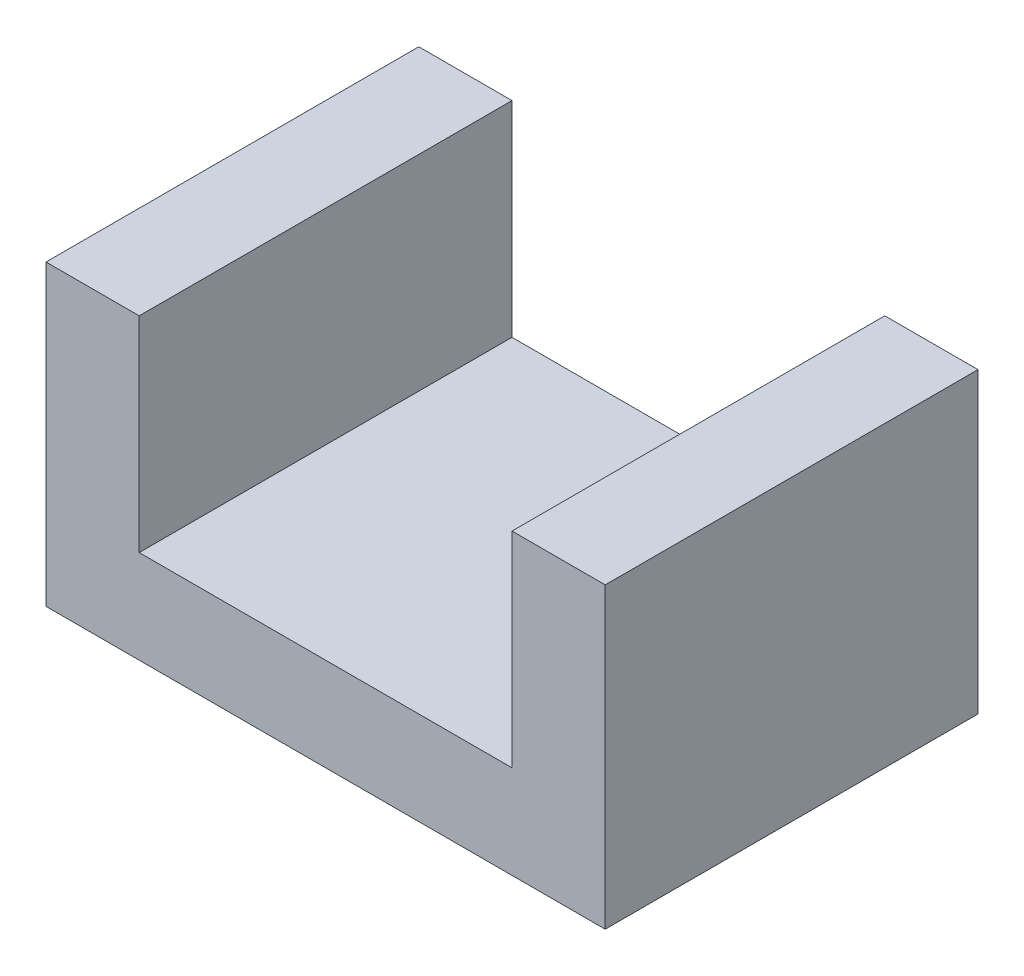
ISO-10303-21;
HEADER;
FILE_DESCRIPTION(('STEP AP214'),'2;1');
FILE_NAME('part.step','',(''),(''),'','','');
FILE_SCHEMA(('AUTOMOTIVE_DESIGN { 1 0 10303 214 1 1 1 1 }'));
ENDSEC;
DATA;
#1=APPLICATION_CONTEXT('core data for automotive mechanical design processes');
#2=APPLICATION_PROTOCOL_DEFINITION('international standard','automotive_design',2000,#1);
#3=PRODUCT_CONTEXT('',#1,'mechanical');
#4=PRODUCT('Part','Part','',(#3));
#5=PRODUCT_RELATED_PRODUCT_CATEGORY('part','',(#4));
#6=PRODUCT_DEFINITION_FORMATION('','',#4);
#7=PRODUCT_DEFINITION_CONTEXT('part definition',#1,'design');
#8=PRODUCT_DEFINITION('design','',#6,#7);
#9=PRODUCT_DEFINITION_SHAPE('','',#8);
#10=(LENGTH_UNIT() NAMED_UNIT(*) SI_UNIT(.MILLI.,.METRE.));
#11=(NAMED_UNIT(*) PLANE_ANGLE_UNIT() SI_UNIT($,.RADIAN.));
#12=(NAMED_UNIT(*) SI_UNIT($,.STERADIAN.) SOLID_ANGLE_UNIT());
#13=UNCERTAINTY_MEASURE_WITH_UNIT(LENGTH_MEASURE(1.E-05),#10,'distance_accuracy_value','');
#14=(GEOMETRIC_REPRESENTATION_CONTEXT(3) GLOBAL_UNCERTAINTY_ASSIGNED_CONTEXT((#13)) GLOBAL_UNIT_ASSIGNED_CONTEXT((#10,
#11,#12)) REPRESENTATION_CONTEXT('',''));
#15=CARTESIAN_POINT('',(0.,0.,0.));
#16=DIRECTION('',(0.,0.,1.));
#17=DIRECTION('',(1.,0.,0.));
#18=AXIS2_PLACEMENT_3D('',#15,#16,#17);
#19=CARTESIAN_POINT('',(-50.,80.,50.));
#20=DIRECTION('',(0.,-1.,0.));
#21=DIRECTION('',(1.,0.,0.));
#22=AXIS2_PLACEMENT_3D('',#19,#20,#21);
#23=PLANE('',#22);
#24=DIRECTION('',(-1.,0.,0.));
#25=VECTOR('',#24,1.);
#26=CARTESIAN_POINT('',(-50.,80.,-50.));
#27=LINE('',#26,#25);
#28=CARTESIAN_POINT('',(-50.,80.,-50.));
#29=VERTEX_POINT('',#28);
#30=CARTESIAN_POINT('',(-75.,80.,-50.));
#31=VERTEX_POINT('',#30);
#32=EDGE_CURVE('E129',#29,#31,#27,.T.);
#33=ORIENTED_EDGE('',*,*,#32,.T.);
#34=DIRECTION('',(0.,0.,-1.));
#35=VECTOR('',#34,1.);
#36=CARTESIAN_POINT('',(-75.,80.,50.));
#37=LINE('',#36,#35);
#38=CARTESIAN_POINT('',(-75.,80.,50.));
#39=VERTEX_POINT('',#38);
#40=EDGE_CURVE('E11',#39,#31,#37,.T.);
#41=ORIENTED_EDGE('',*,*,#40,.F.);
#42=DIRECTION('',(-1.,0.,0.));
#43=VECTOR('',#42,1.);
#44=CARTESIAN_POINT('',(-50.,80.,50.));
#45=LINE('',#44,#43);
#46=CARTESIAN_POINT('',(-50.,80.,50.));
#47=VERTEX_POINT('',#46);
#48=EDGE_CURVE('E143',#47,#39,#45,.T.);
#49=ORIENTED_EDGE('',*,*,#48,.F.);
#50=DIRECTION('',(0.,0.,-1.));
#51=VECTOR('',#50,1.);
#52=CARTESIAN_POINT('',(-50.,80.,50.));
#53=LINE('',#52,#51);
#54=EDGE_CURVE('E125',#47,#29,#53,.T.);
#55=ORIENTED_EDGE('',*,*,#54,.T.);
#56=EDGE_LOOP('',(#33,#41,#49,#55));
#57=FACE_BOUND('',#56,.T.);
#58=ADVANCED_FACE('F33',(#57),#23,.F.);
#59=CARTESIAN_POINT('',(-75.,80.,50.));
#60=DIRECTION('',(1.,0.,0.));
#61=DIRECTION('',(0.,1.,0.));
#62=AXIS2_PLACEMENT_3D('',#59,#60,#61);
#63=PLANE('',#62);
#64=DIRECTION('',(0.,-1.,0.));
#65=VECTOR('',#64,1.);
#66=CARTESIAN_POINT('',(-75.,80.,-50.));
#67=LINE('',#66,#65);
#68=CARTESIAN_POINT('',(-75.,0.,-50.));
#69=VERTEX_POINT('',#68);
#70=EDGE_CURVE('E132',#31,#69,#67,.T.);
#71=ORIENTED_EDGE('',*,*,#70,.T.);
#72=DIRECTION('',(0.,0.,-1.));
#73=VECTOR('',#72,1.);
#74=CARTESIAN_POINT('',(-75.,0.,50.));
#75=LINE('',#74,#73);
#76=CARTESIAN_POINT('',(-75.,0.,50.));
#77=VERTEX_POINT('',#76);
#78=EDGE_CURVE('E41',#77,#69,#75,.T.);
#79=ORIENTED_EDGE('',*,*,#78,.F.);
#80=DIRECTION('',(0.,-1.,0.));
#81=VECTOR('',#80,1.);
#82=CARTESIAN_POINT('',(-75.,80.,50.));
#83=LINE('',#82,#81);
#84=EDGE_CURVE('E92',#39,#77,#83,.T.);
#85=ORIENTED_EDGE('',*,*,#84,.F.);
#86=ORIENTED_EDGE('',*,*,#40,.T.);
#87=EDGE_LOOP('',(#71,#79,#85,#86));
#88=FACE_BOUND('',#87,.T.);
#89=ADVANCED_FACE('F178',(#88),#63,.F.);
#90=CARTESIAN_POINT('',(-75.,0.,50.));
#91=DIRECTION('',(0.,1.,0.));
#92=DIRECTION('',(-1.,0.,0.));
#93=AXIS2_PLACEMENT_3D('',#90,#91,#92);
#94=PLANE('',#93);
#95=DIRECTION('',(1.,0.,0.));
#96=VECTOR('',#95,1.);
#97=CARTESIAN_POINT('',(-75.,0.,-50.));
#98=LINE('',#97,#96);
#99=CARTESIAN_POINT('',(75.,0.,-50.));
#100=VERTEX_POINT('',#99);
#101=EDGE_CURVE('E134',#69,#100,#98,.T.);
#102=ORIENTED_EDGE('',*,*,#101,.T.);
#103=DIRECTION('',(0.,0.,-1.));
#104=VECTOR('',#103,1.);
#105=CARTESIAN_POINT('',(75.,0.,50.));
#106=LINE('',#105,#104);
#107=CARTESIAN_POINT('',(75.,0.,50.));
#108=VERTEX_POINT('',#107);
#109=EDGE_CURVE('E150',#108,#100,#106,.T.);
#110=ORIENTED_EDGE('',*,*,#109,.F.);
#111=DIRECTION('',(1.,0.,0.));
#112=VECTOR('',#111,1.);
#113=CARTESIAN_POINT('',(-75.,0.,50.));
#114=LINE('',#113,#112);
#115=EDGE_CURVE('E158',#77,#108,#114,.T.);
#116=ORIENTED_EDGE('',*,*,#115,.F.);
#117=ORIENTED_EDGE('',*,*,#78,.T.);
#118=EDGE_LOOP('',(#102,#110,#116,#117));
#119=FACE_BOUND('',#118,.T.);
#120=ADVANCED_FACE('F156',(#119),#94,.F.);
#121=CARTESIAN_POINT('',(75.,0.,50.));
#122=DIRECTION('',(-1.,0.,0.));
#123=DIRECTION('',(0.,-1.,0.));
#124=AXIS2_PLACEMENT_3D('',#121,#122,#123);
#125=PLANE('',#124);
#126=DIRECTION('',(0.,1.,0.));
#127=VECTOR('',#126,1.);
#128=CARTESIAN_POINT('',(75.,0.,-50.));
#129=LINE('',#128,#127);
#130=CARTESIAN_POINT('',(75.,80.,-50.));
#131=VERTEX_POINT('',#130);
#132=EDGE_CURVE('E136',#100,#131,#129,.T.);
#133=ORIENTED_EDGE('',*,*,#132,.T.);
#134=DIRECTION('',(0.,0.,-1.));
#135=VECTOR('',#134,1.);
#136=CARTESIAN_POINT('',(75.,80.,50.));
#137=LINE('',#136,#135);
#138=CARTESIAN_POINT('',(75.,80.,50.));
#139=VERTEX_POINT('',#138);
#140=EDGE_CURVE('E147',#139,#131,#137,.T.);
#141=ORIENTED_EDGE('',*,*,#140,.F.);
#142=DIRECTION('',(0.,1.,0.));
#143=VECTOR('',#142,1.);
#144=CARTESIAN_POINT('',(75.,0.,50.));
#145=LINE('',#144,#143);
#146=EDGE_CURVE('E170',#108,#139,#145,.T.);
#147=ORIENTED_EDGE('',*,*,#146,.F.);
#148=ORIENTED_EDGE('',*,*,#109,.T.);
#149=EDGE_LOOP('',(#133,#141,#147,#148));
#150=FACE_BOUND('',#149,.T.);
#151=ADVANCED_FACE('F166',(#150),#125,.F.);
#152=CARTESIAN_POINT('',(75.,80.,50.));
#153=DIRECTION('',(0.,-1.,0.));
#154=DIRECTION('',(0.,0.,-1.));
#155=AXIS2_PLACEMENT_3D('',#152,#153,#154);
#156=PLANE('',#155);
#157=DIRECTION('',(-1.,0.,0.));
#158=VECTOR('',#157,1.);
#159=CARTESIAN_POINT('',(75.,80.,-50.));
#160=LINE('',#159,#158);
#161=CARTESIAN_POINT('',(50.,80.,-50.));
#162=VERTEX_POINT('',#161);
#163=EDGE_CURVE('E138',#131,#162,#160,.T.);
#164=ORIENTED_EDGE('',*,*,#163,.T.);
#165=DIRECTION('',(0.,0.,-1.));
#166=VECTOR('',#165,1.);
#167=CARTESIAN_POINT('',(50.,80.,50.));
#168=LINE('',#167,#166);
#169=CARTESIAN_POINT('',(50.,80.,50.));
#170=VERTEX_POINT('',#169);
#171=EDGE_CURVE('E120',#170,#162,#168,.T.);
#172=ORIENTED_EDGE('',*,*,#171,.F.);
#173=DIRECTION('',(-1.,0.,0.));
#174=VECTOR('',#173,1.);
#175=CARTESIAN_POINT('',(75.,80.,50.));
#176=LINE('',#175,#174);
#177=EDGE_CURVE('E111',#139,#170,#176,.T.);
#178=ORIENTED_EDGE('',*,*,#177,.F.);
#179=ORIENTED_EDGE('',*,*,#140,.T.);
#180=EDGE_LOOP('',(#164,#172,#178,#179));
#181=FACE_BOUND('',#180,.T.);
#182=ADVANCED_FACE('F169',(#181),#156,.F.);
#183=CARTESIAN_POINT('',(50.,80.,50.));
#184=DIRECTION('',(1.,0.,0.));
#185=DIRECTION('',(0.,1.,0.));
#186=AXIS2_PLACEMENT_3D('',#183,#184,#185);
#187=PLANE('',#186);
#188=DIRECTION('',(0.,-1.,0.));
#189=VECTOR('',#188,1.);
#190=CARTESIAN_POINT('',(50.,80.,-50.));
#191=LINE('',#190,#189);
#192=CARTESIAN_POINT('',(50.,25.,-50.));
#193=VERTEX_POINT('',#192);
#194=EDGE_CURVE('E119',#162,#193,#191,.T.);
#195=ORIENTED_EDGE('',*,*,#194,.T.);
#196=DIRECTION('',(0.,0.,-1.));
#197=VECTOR('',#196,1.);
#198=CARTESIAN_POINT('',(50.,25.,50.));
#199=LINE('',#198,#197);
#200=CARTESIAN_POINT('',(50.,25.,50.));
#201=VERTEX_POINT('',#200);
#202=EDGE_CURVE('E116',#201,#193,#199,.T.);
#203=ORIENTED_EDGE('',*,*,#202,.F.);
#204=DIRECTION('',(0.,-1.,0.));
#205=VECTOR('',#204,1.);
#206=CARTESIAN_POINT('',(50.,80.,50.));
#207=LINE('',#206,#205);
#208=EDGE_CURVE('E105',#170,#201,#207,.T.);
#209=ORIENTED_EDGE('',*,*,#208,.F.);
#210=ORIENTED_EDGE('',*,*,#171,.T.);
#211=EDGE_LOOP('',(#195,#203,#209,#210));
#212=FACE_BOUND('',#211,.T.);
#213=ADVANCED_FACE('F117',(#212),#187,.F.);
#214=CARTESIAN_POINT('',(50.,25.,50.));
#215=DIRECTION('',(0.,-1.,0.));
#216=DIRECTION('',(1.,0.,0.));
#217=AXIS2_PLACEMENT_3D('',#214,#215,#216);
#218=PLANE('',#217);
#219=DIRECTION('',(-1.,0.,0.));
#220=VECTOR('',#219,1.);
#221=CARTESIAN_POINT('',(50.,25.,-50.));
#222=LINE('',#221,#220);
#223=CARTESIAN_POINT('',(-50.,25.,-50.));
#224=VERTEX_POINT('',#223);
#225=EDGE_CURVE('E78',#193,#224,#222,.T.);
#226=ORIENTED_EDGE('',*,*,#225,.T.);
#227=DIRECTION('',(0.,0.,-1.));
#228=VECTOR('',#227,1.);
#229=CARTESIAN_POINT('',(-50.,25.,50.));
#230=LINE('',#229,#228);
#231=CARTESIAN_POINT('',(-50.,25.,50.));
#232=VERTEX_POINT('',#231);
#233=EDGE_CURVE('E121',#232,#224,#230,.T.);
#234=ORIENTED_EDGE('',*,*,#233,.F.);
#235=DIRECTION('',(-1.,0.,0.));
#236=VECTOR('',#235,1.);
#237=CARTESIAN_POINT('',(50.,25.,50.));
#238=LINE('',#237,#236);
#239=EDGE_CURVE('E109',#201,#232,#238,.T.);
#240=ORIENTED_EDGE('',*,*,#239,.F.);
#241=ORIENTED_EDGE('',*,*,#202,.T.);
#242=EDGE_LOOP('',(#226,#234,#240,#241));
#243=FACE_BOUND('',#242,.T.);
#244=ADVANCED_FACE('F123',(#243),#218,.F.);
#245=CARTESIAN_POINT('',(-50.,25.,50.));
#246=DIRECTION('',(-1.,0.,0.));
#247=DIRECTION('',(0.,0.,1.));
#248=AXIS2_PLACEMENT_3D('',#245,#246,#247);
#249=PLANE('',#248);
#250=DIRECTION('',(0.,1.,0.));
#251=VECTOR('',#250,1.);
#252=CARTESIAN_POINT('',(-50.,25.,-50.));
#253=LINE('',#252,#251);
#254=EDGE_CURVE('E84',#224,#29,#253,.T.);
#255=ORIENTED_EDGE('',*,*,#254,.T.);
#256=ORIENTED_EDGE('',*,*,#54,.F.);
#257=DIRECTION('',(0.,1.,0.));
#258=VECTOR('',#257,1.);
#259=CARTESIAN_POINT('',(-50.,25.,50.));
#260=LINE('',#259,#258);
#261=EDGE_CURVE('E49',#232,#47,#260,.T.);
#262=ORIENTED_EDGE('',*,*,#261,.F.);
#263=ORIENTED_EDGE('',*,*,#233,.T.);
#264=EDGE_LOOP('',(#255,#256,#262,#263));
#265=FACE_BOUND('',#264,.T.);
#266=ADVANCED_FACE('F194',(#265),#249,.F.);
#267=CARTESIAN_POINT('',(0.,0.,50.));
#268=DIRECTION('',(0.,0.,1.));
#269=DIRECTION('',(1.,0.,0.));
#270=AXIS2_PLACEMENT_3D('',#267,#268,#269);
#271=PLANE('',#270);
#272=ORIENTED_EDGE('',*,*,#48,.T.);
#273=ORIENTED_EDGE('',*,*,#84,.T.);
#274=ORIENTED_EDGE('',*,*,#115,.T.);
#275=ORIENTED_EDGE('',*,*,#146,.T.);
#276=ORIENTED_EDGE('',*,*,#177,.T.);
#277=ORIENTED_EDGE('',*,*,#208,.T.);
#278=ORIENTED_EDGE('',*,*,#239,.T.);
#279=ORIENTED_EDGE('',*,*,#261,.T.);
#280=EDGE_LOOP('',(#272,#273,#274,#275,#276,#277,#278,#279));
#281=FACE_BOUND('',#280,.T.);
#282=ADVANCED_FACE('F107',(#281),#271,.T.);
#283=CARTESIAN_POINT('',(0.,0.,-50.));
#284=DIRECTION('',(0.,0.,1.));
#285=DIRECTION('',(1.,0.,0.));
#286=AXIS2_PLACEMENT_3D('',#283,#284,#285);
#287=PLANE('',#286);
#288=ORIENTED_EDGE('',*,*,#32,.F.);
#289=ORIENTED_EDGE('',*,*,#254,.F.);
#290=ORIENTED_EDGE('',*,*,#225,.F.);
#291=ORIENTED_EDGE('',*,*,#194,.F.);
#292=ORIENTED_EDGE('',*,*,#163,.F.);
#293=ORIENTED_EDGE('',*,*,#132,.F.);
#294=ORIENTED_EDGE('',*,*,#101,.F.);
#295=ORIENTED_EDGE('',*,*,#70,.F.);
#296=EDGE_LOOP('',(#288,#289,#290,#291,#292,#293,#294,#295));
#297=FACE_BOUND('',#296,.T.);
#298=ADVANCED_FACE('F162',(#297),#287,.F.);
#299=CLOSED_SHELL('',(#58,#89,#120,#151,#182,#213,#244,#266,#282,#298));
#300=MANIFOLD_SOLID_BREP('B2',#299);
#301=ADVANCED_BREP_SHAPE_REPRESENTATION('',(#18,#300),#14);
#302=SHAPE_DEFINITION_REPRESENTATION(#9,#301);
ENDSEC;
END-ISO-10303-21;
